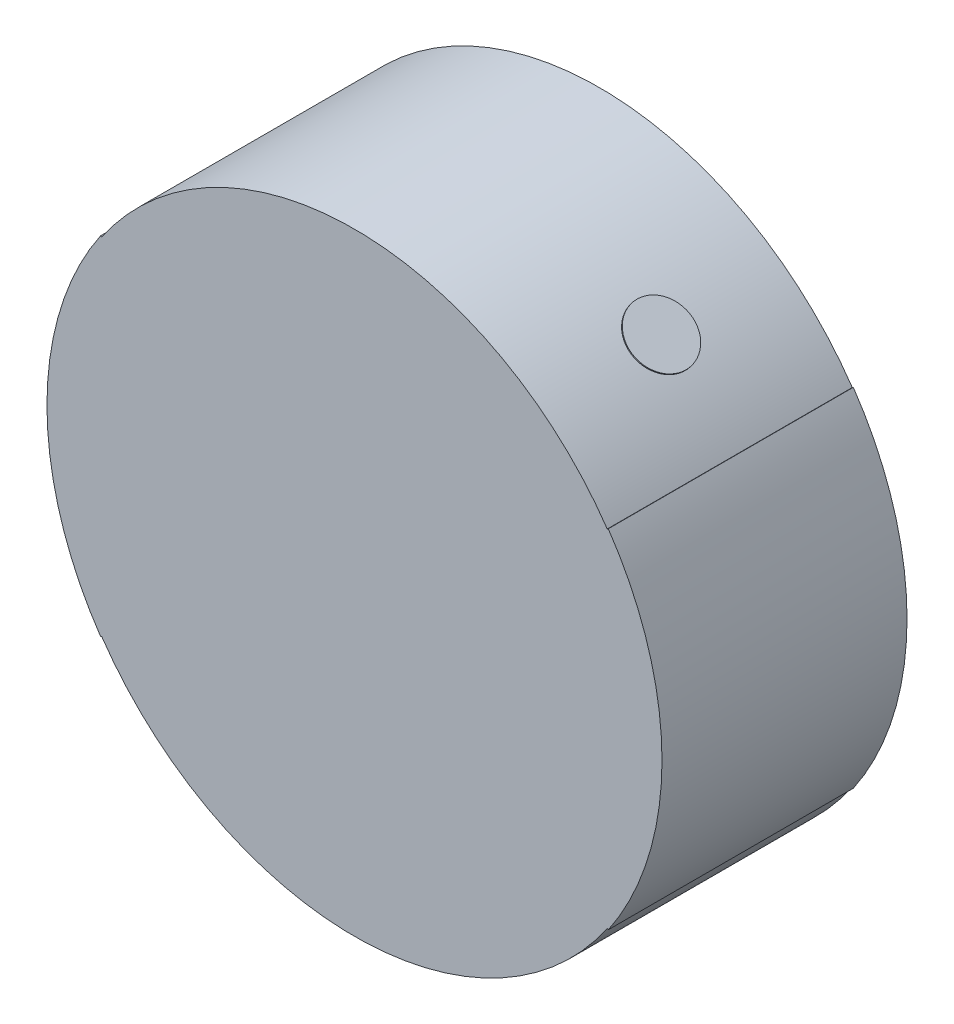
ISO-10303-21;
HEADER;
FILE_DESCRIPTION(('STEP AP214'),'2;1');
FILE_NAME('part.step','',(''),(''),'','','');
FILE_SCHEMA(('AUTOMOTIVE_DESIGN { 1 0 10303 214 1 1 1 1 }'));
ENDSEC;
DATA;
#1=APPLICATION_CONTEXT('core data for automotive mechanical design processes');
#2=APPLICATION_PROTOCOL_DEFINITION('international standard','automotive_design',2000,#1);
#3=PRODUCT_CONTEXT('',#1,'mechanical');
#4=PRODUCT('Part','Part','',(#3));
#5=PRODUCT_RELATED_PRODUCT_CATEGORY('part','',(#4));
#6=PRODUCT_DEFINITION_FORMATION('','',#4);
#7=PRODUCT_DEFINITION_CONTEXT('part definition',#1,'design');
#8=PRODUCT_DEFINITION('design','',#6,#7);
#9=PRODUCT_DEFINITION_SHAPE('','',#8);
#10=(LENGTH_UNIT() NAMED_UNIT(*) SI_UNIT(.MILLI.,.METRE.));
#11=(NAMED_UNIT(*) PLANE_ANGLE_UNIT() SI_UNIT($,.RADIAN.));
#12=(NAMED_UNIT(*) SI_UNIT($,.STERADIAN.) SOLID_ANGLE_UNIT());
#13=UNCERTAINTY_MEASURE_WITH_UNIT(LENGTH_MEASURE(1.E-05),#10,'distance_accuracy_value','');
#14=(GEOMETRIC_REPRESENTATION_CONTEXT(3) GLOBAL_UNCERTAINTY_ASSIGNED_CONTEXT((#13)) GLOBAL_UNIT_ASSIGNED_CONTEXT((#10,
#11,#12)) REPRESENTATION_CONTEXT('',''));
#15=CARTESIAN_POINT('',(0.,0.,0.));
#16=DIRECTION('',(0.,0.,1.));
#17=DIRECTION('',(1.,0.,0.));
#18=AXIS2_PLACEMENT_3D('',#15,#16,#17);
#19=CARTESIAN_POINT('',(1.506,2.008,0.));
#20=DIRECTION('',(-0.6,-0.8,0.));
#21=DIRECTION('',(0.8,-0.6,0.));
#22=AXIS2_PLACEMENT_3D('',#19,#20,#21);
#23=CYLINDRICAL_SURFACE('',#22,0.25);
#24=CARTESIAN_POINT('',(1.506,2.008,0.));
#25=DIRECTION('',(0.6,0.8,0.));
#26=DIRECTION('',(-0.8,0.6,0.));
#27=AXIS2_PLACEMENT_3D('',#24,#25,#26);
#28=CIRCLE('',#27,0.25);
#29=CARTESIAN_POINT('',(1.306,2.158,0.));
#30=VERTEX_POINT('',#29);
#31=EDGE_CURVE('E11',#30,#30,#28,.T.);
#32=ORIENTED_EDGE('',*,*,#31,.F.);
#33=EDGE_LOOP('',(#32));
#34=FACE_BOUND('',#33,.T.);
#35=CARTESIAN_POINT('',(1.5,2.,0.));
#36=DIRECTION('',(0.6,0.8,0.));
#37=DIRECTION('',(-0.8,0.6,0.));
#38=AXIS2_PLACEMENT_3D('',#35,#36,#37);
#39=CIRCLE('',#38,0.25);
#40=CARTESIAN_POINT('',(1.3,2.15,0.));
#41=VERTEX_POINT('',#40);
#42=EDGE_CURVE('E46',#41,#41,#39,.T.);
#43=ORIENTED_EDGE('',*,*,#42,.T.);
#44=EDGE_LOOP('',(#43));
#45=FACE_BOUND('',#44,.T.);
#46=ADVANCED_FACE('F43',(#34,#45),#23,.T.);
#47=CARTESIAN_POINT('',(1.506,2.008,0.));
#48=DIRECTION('',(0.6,0.8,0.));
#49=DIRECTION('',(-0.8,0.6,0.));
#50=AXIS2_PLACEMENT_3D('',#47,#48,#49);
#51=PLANE('',#50);
#52=ORIENTED_EDGE('',*,*,#31,.T.);
#53=EDGE_LOOP('',(#52));
#54=FACE_BOUND('',#53,.T.);
#55=ADVANCED_FACE('F58',(#54),#51,.T.);
#56=CARTESIAN_POINT('',(1.5,2.,0.));
#57=DIRECTION('',(0.6,0.8,0.));
#58=DIRECTION('',(-0.8,0.6,0.));
#59=AXIS2_PLACEMENT_3D('',#56,#57,#58);
#60=PLANE('',#59);
#61=ORIENTED_EDGE('',*,*,#42,.F.);
#62=EDGE_LOOP('',(#61));
#63=FACE_BOUND('',#62,.T.);
#64=ADVANCED_FACE('F56',(#63),#60,.F.);
#65=CLOSED_SHELL('',(#46,#55,#64));
#66=MANIFOLD_SOLID_BREP('B2',#65);
#67=CARTESIAN_POINT('',(0.,0.,1.));
#68=DIRECTION('',(0.,0.,-1.));
#69=DIRECTION('',(-1.,0.,0.));
#70=AXIS2_PLACEMENT_3D('',#67,#68,#69);
#71=CYLINDRICAL_SURFACE('',#70,2.5);
#72=DIRECTION('',(0.,0.,1.));
#73=VECTOR('',#72,1.);
#74=CARTESIAN_POINT('',(-2.0633390372742,-1.41160618348759,-1.));
#75=LINE('',#74,#73);
#76=CARTESIAN_POINT('',(-2.0633390372742,-1.41160618348759,-1.));
#77=VERTEX_POINT('',#76);
#78=CARTESIAN_POINT('',(-2.0633390372742,-1.41160618348759,1.));
#79=VERTEX_POINT('',#78);
#80=EDGE_CURVE('E178',#77,#79,#75,.T.);
#81=ORIENTED_EDGE('',*,*,#80,.F.);
#82=CARTESIAN_POINT('',(0.,0.,-1.));
#83=DIRECTION('',(0.,0.,1.));
#84=DIRECTION('',(1.,0.,0.));
#85=AXIS2_PLACEMENT_3D('',#82,#83,#84);
#86=CIRCLE('',#85,2.5);
#87=CARTESIAN_POINT('',(2.0633390372742,-1.41160618348759,-1.));
#88=VERTEX_POINT('',#87);
#89=EDGE_CURVE('E205',#77,#88,#86,.T.);
#90=ORIENTED_EDGE('',*,*,#89,.T.);
#91=DIRECTION('',(0.,0.,1.));
#92=VECTOR('',#91,1.);
#93=CARTESIAN_POINT('',(2.0633390372742,-1.41160618348759,-1.));
#94=LINE('',#93,#92);
#95=CARTESIAN_POINT('',(2.0633390372742,-1.41160618348759,1.));
#96=VERTEX_POINT('',#95);
#97=EDGE_CURVE('E194',#88,#96,#94,.T.);
#98=ORIENTED_EDGE('',*,*,#97,.T.);
#99=CARTESIAN_POINT('',(0.,0.,1.));
#100=DIRECTION('',(0.,0.,1.));
#101=DIRECTION('',(1.,0.,0.));
#102=AXIS2_PLACEMENT_3D('',#99,#100,#101);
#103=CIRCLE('',#102,2.5);
#104=EDGE_CURVE('E92',#79,#96,#103,.T.);
#105=ORIENTED_EDGE('',*,*,#104,.F.);
#106=EDGE_LOOP('',(#81,#90,#98,#105));
#107=FACE_BOUND('',#106,.T.);
#108=ADVANCED_FACE('F84',(#107),#71,.T.);
#109=DIRECTION('',(0.,0.,1.));
#110=VECTOR('',#109,1.);
#111=CARTESIAN_POINT('',(-2.0633390372742,1.41160618348759,-1.));
#112=LINE('',#111,#110);
#113=CARTESIAN_POINT('',(-2.0633390372742,1.41160618348759,-1.));
#114=VERTEX_POINT('',#113);
#115=CARTESIAN_POINT('',(-2.0633390372742,1.41160618348759,1.));
#116=VERTEX_POINT('',#115);
#117=EDGE_CURVE('E106',#114,#116,#112,.T.);
#118=ORIENTED_EDGE('',*,*,#117,.T.);
#119=CARTESIAN_POINT('',(2.0633390372742,1.41160618348759,1.));
#120=VERTEX_POINT('',#119);
#121=EDGE_CURVE('E41',#120,#116,#103,.T.);
#122=ORIENTED_EDGE('',*,*,#121,.F.);
#123=DIRECTION('',(0.,0.,1.));
#124=VECTOR('',#123,1.);
#125=CARTESIAN_POINT('',(2.0633390372742,1.41160618348759,-1.));
#126=LINE('',#125,#124);
#127=CARTESIAN_POINT('',(2.0633390372742,1.41160618348759,-1.));
#128=VERTEX_POINT('',#127);
#129=EDGE_CURVE('E202',#128,#120,#126,.T.);
#130=ORIENTED_EDGE('',*,*,#129,.F.);
#131=EDGE_CURVE('E87',#128,#114,#86,.T.);
#132=ORIENTED_EDGE('',*,*,#131,.T.);
#133=EDGE_LOOP('',(#118,#122,#130,#132));
#134=FACE_BOUND('',#133,.T.);
#135=ADVANCED_FACE('F220',(#134),#71,.T.);
#136=CARTESIAN_POINT('',(0.,0.,1.));
#137=DIRECTION('',(0.,0.,1.));
#138=DIRECTION('',(1.,0.,0.));
#139=AXIS2_PLACEMENT_3D('',#136,#137,#138);
#140=PLANE('',#139);
#141=ORIENTED_EDGE('',*,*,#121,.T.);
#142=DIRECTION('',(0.825335614909667,-0.564642473395052,0.));
#143=VECTOR('',#142,1.);
#144=CARTESIAN_POINT('',(-2.0633390372742,1.41160618348759,1.));
#145=LINE('',#144,#143);
#146=CARTESIAN_POINT('',(-2.07159239342329,1.41725260822154,1.));
#147=VERTEX_POINT('',#146);
#148=EDGE_CURVE('E175',#147,#116,#145,.T.);
#149=ORIENTED_EDGE('',*,*,#148,.F.);
#150=CARTESIAN_POINT('',(0.,0.,1.));
#151=DIRECTION('',(0.,0.,-1.));
#152=DIRECTION('',(1.,0.,0.));
#153=AXIS2_PLACEMENT_3D('',#150,#151,#152);
#154=CIRCLE('',#153,2.51);
#155=CARTESIAN_POINT('',(-2.07159239342329,-1.41725260822154,1.));
#156=VERTEX_POINT('',#155);
#157=EDGE_CURVE('E163',#156,#147,#154,.T.);
#158=ORIENTED_EDGE('',*,*,#157,.F.);
#159=DIRECTION('',(-0.825335614909681,-0.564642473395032,0.));
#160=VECTOR('',#159,1.);
#161=CARTESIAN_POINT('',(-2.0633390372742,-1.41160618348759,1.));
#162=LINE('',#161,#160);
#163=EDGE_CURVE('E170',#79,#156,#162,.T.);
#164=ORIENTED_EDGE('',*,*,#163,.F.);
#165=ORIENTED_EDGE('',*,*,#104,.T.);
#166=DIRECTION('',(0.825335614909681,-0.564642473395032,0.));
#167=VECTOR('',#166,1.);
#168=CARTESIAN_POINT('',(2.0633390372742,-1.41160618348759,1.));
#169=LINE('',#168,#167);
#170=CARTESIAN_POINT('',(2.07159239342329,-1.41725260822154,1.));
#171=VERTEX_POINT('',#170);
#172=EDGE_CURVE('E181',#96,#171,#169,.T.);
#173=ORIENTED_EDGE('',*,*,#172,.T.);
#174=CARTESIAN_POINT('',(0.,0.,1.));
#175=DIRECTION('',(0.,0.,1.));
#176=DIRECTION('',(-1.,0.,0.));
#177=AXIS2_PLACEMENT_3D('',#174,#175,#176);
#178=CIRCLE('',#177,2.51);
#179=CARTESIAN_POINT('',(2.07159239342329,1.41725260822154,1.));
#180=VERTEX_POINT('',#179);
#181=EDGE_CURVE('E197',#171,#180,#178,.T.);
#182=ORIENTED_EDGE('',*,*,#181,.T.);
#183=DIRECTION('',(-0.825335614909667,-0.564642473395052,0.));
#184=VECTOR('',#183,1.);
#185=CARTESIAN_POINT('',(2.0633390372742,1.41160618348759,1.));
#186=LINE('',#185,#184);
#187=EDGE_CURVE('E188',#180,#120,#186,.T.);
#188=ORIENTED_EDGE('',*,*,#187,.T.);
#189=EDGE_LOOP('',(#141,#149,#158,#164,#165,#173,#182,#188));
#190=FACE_BOUND('',#189,.T.);
#191=ADVANCED_FACE('F217',(#190),#140,.T.);
#192=CARTESIAN_POINT('',(0.,0.,-1.));
#193=DIRECTION('',(0.,0.,1.));
#194=DIRECTION('',(1.,0.,0.));
#195=AXIS2_PLACEMENT_3D('',#192,#193,#194);
#196=PLANE('',#195);
#197=ORIENTED_EDGE('',*,*,#131,.F.);
#198=DIRECTION('',(-0.825335614909667,-0.564642473395052,0.));
#199=VECTOR('',#198,1.);
#200=CARTESIAN_POINT('',(2.0633390372742,1.41160618348759,-1.));
#201=LINE('',#200,#199);
#202=CARTESIAN_POINT('',(2.07159239342329,1.41725260822154,-1.));
#203=VERTEX_POINT('',#202);
#204=EDGE_CURVE('E191',#203,#128,#201,.T.);
#205=ORIENTED_EDGE('',*,*,#204,.F.);
#206=CARTESIAN_POINT('',(0.,0.,-1.));
#207=DIRECTION('',(0.,0.,1.));
#208=DIRECTION('',(-1.,0.,0.));
#209=AXIS2_PLACEMENT_3D('',#206,#207,#208);
#210=CIRCLE('',#209,2.51);
#211=CARTESIAN_POINT('',(2.07159239342329,-1.41725260822154,-1.));
#212=VERTEX_POINT('',#211);
#213=EDGE_CURVE('E187',#212,#203,#210,.T.);
#214=ORIENTED_EDGE('',*,*,#213,.F.);
#215=DIRECTION('',(0.825335614909681,-0.564642473395032,0.));
#216=VECTOR('',#215,1.);
#217=CARTESIAN_POINT('',(2.0633390372742,-1.41160618348759,-1.));
#218=LINE('',#217,#216);
#219=EDGE_CURVE('E184',#88,#212,#218,.T.);
#220=ORIENTED_EDGE('',*,*,#219,.F.);
#221=ORIENTED_EDGE('',*,*,#89,.F.);
#222=DIRECTION('',(-0.825335614909681,-0.564642473395032,0.));
#223=VECTOR('',#222,1.);
#224=CARTESIAN_POINT('',(-2.0633390372742,-1.41160618348759,-1.));
#225=LINE('',#224,#223);
#226=CARTESIAN_POINT('',(-2.07159239342329,-1.41725260822154,-1.));
#227=VERTEX_POINT('',#226);
#228=EDGE_CURVE('E154',#77,#227,#225,.T.);
#229=ORIENTED_EDGE('',*,*,#228,.T.);
#230=CARTESIAN_POINT('',(0.,0.,-1.));
#231=DIRECTION('',(0.,0.,-1.));
#232=DIRECTION('',(1.,0.,0.));
#233=AXIS2_PLACEMENT_3D('',#230,#231,#232);
#234=CIRCLE('',#233,2.51);
#235=CARTESIAN_POINT('',(-2.07159239342329,1.41725260822154,-1.));
#236=VERTEX_POINT('',#235);
#237=EDGE_CURVE('E148',#227,#236,#234,.T.);
#238=ORIENTED_EDGE('',*,*,#237,.T.);
#239=DIRECTION('',(0.825335614909667,-0.564642473395052,0.));
#240=VECTOR('',#239,1.);
#241=CARTESIAN_POINT('',(-2.0633390372742,1.41160618348759,-1.));
#242=LINE('',#241,#240);
#243=EDGE_CURVE('E152',#236,#114,#242,.T.);
#244=ORIENTED_EDGE('',*,*,#243,.T.);
#245=EDGE_LOOP('',(#197,#205,#214,#220,#221,#229,#238,#244));
#246=FACE_BOUND('',#245,.T.);
#247=ADVANCED_FACE('F150',(#246),#196,.F.);
#248=CARTESIAN_POINT('',(2.0633390372742,1.41160618348759,-1.));
#249=DIRECTION('',(-0.564642473395052,0.825335614909667,0.));
#250=DIRECTION('',(-0.825335614909667,-0.564642473395052,0.));
#251=AXIS2_PLACEMENT_3D('',#248,#249,#250);
#252=PLANE('',#251);
#253=ORIENTED_EDGE('',*,*,#187,.F.);
#254=DIRECTION('',(0.,0.,1.));
#255=VECTOR('',#254,1.);
#256=CARTESIAN_POINT('',(2.07159239342329,1.41725260822154,-1.));
#257=LINE('',#256,#255);
#258=EDGE_CURVE('E206',#203,#180,#257,.T.);
#259=ORIENTED_EDGE('',*,*,#258,.F.);
#260=ORIENTED_EDGE('',*,*,#204,.T.);
#261=ORIENTED_EDGE('',*,*,#129,.T.);
#262=EDGE_LOOP('',(#253,#259,#260,#261));
#263=FACE_BOUND('',#262,.T.);
#264=ADVANCED_FACE('F224',(#263),#252,.T.);
#265=CARTESIAN_POINT('',(0.,0.,-1.));
#266=DIRECTION('',(0.,0.,1.));
#267=DIRECTION('',(1.,0.,0.));
#268=AXIS2_PLACEMENT_3D('',#265,#266,#267);
#269=CYLINDRICAL_SURFACE('',#268,2.51);
#270=ORIENTED_EDGE('',*,*,#181,.F.);
#271=DIRECTION('',(0.,0.,1.));
#272=VECTOR('',#271,1.);
#273=CARTESIAN_POINT('',(2.07159239342329,-1.41725260822154,-1.));
#274=LINE('',#273,#272);
#275=EDGE_CURVE('E208',#212,#171,#274,.T.);
#276=ORIENTED_EDGE('',*,*,#275,.F.);
#277=ORIENTED_EDGE('',*,*,#213,.T.);
#278=ORIENTED_EDGE('',*,*,#258,.T.);
#279=EDGE_LOOP('',(#270,#276,#277,#278));
#280=FACE_BOUND('',#279,.T.);
#281=ADVANCED_FACE('F226',(#280),#269,.T.);
#282=CARTESIAN_POINT('',(2.0633390372742,-1.41160618348759,-1.));
#283=DIRECTION('',(-0.564642473395032,-0.825335614909681,0.));
#284=DIRECTION('',(0.825335614909681,-0.564642473395032,0.));
#285=AXIS2_PLACEMENT_3D('',#282,#283,#284);
#286=PLANE('',#285);
#287=ORIENTED_EDGE('',*,*,#172,.F.);
#288=ORIENTED_EDGE('',*,*,#97,.F.);
#289=ORIENTED_EDGE('',*,*,#219,.T.);
#290=ORIENTED_EDGE('',*,*,#275,.T.);
#291=EDGE_LOOP('',(#287,#288,#289,#290));
#292=FACE_BOUND('',#291,.T.);
#293=ADVANCED_FACE('F214',(#292),#286,.T.);
#294=CARTESIAN_POINT('',(-2.0633390372742,-1.41160618348759,-1.));
#295=DIRECTION('',(-0.564642473395032,0.825335614909681,0.));
#296=DIRECTION('',(-0.825335614909681,-0.564642473395032,0.));
#297=AXIS2_PLACEMENT_3D('',#294,#295,#296);
#298=PLANE('',#297);
#299=ORIENTED_EDGE('',*,*,#163,.T.);
#300=DIRECTION('',(0.,0.,1.));
#301=VECTOR('',#300,1.);
#302=CARTESIAN_POINT('',(-2.07159239342329,-1.41725260822154,-1.));
#303=LINE('',#302,#301);
#304=EDGE_CURVE('E167',#227,#156,#303,.T.);
#305=ORIENTED_EDGE('',*,*,#304,.F.);
#306=ORIENTED_EDGE('',*,*,#228,.F.);
#307=ORIENTED_EDGE('',*,*,#80,.T.);
#308=EDGE_LOOP('',(#299,#305,#306,#307));
#309=FACE_BOUND('',#308,.T.);
#310=ADVANCED_FACE('F233',(#309),#298,.F.);
#311=CARTESIAN_POINT('',(0.,0.,-1.));
#312=DIRECTION('',(0.,0.,1.));
#313=DIRECTION('',(1.,0.,0.));
#314=AXIS2_PLACEMENT_3D('',#311,#312,#313);
#315=CYLINDRICAL_SURFACE('',#314,2.51);
#316=ORIENTED_EDGE('',*,*,#157,.T.);
#317=DIRECTION('',(0.,0.,1.));
#318=VECTOR('',#317,1.);
#319=CARTESIAN_POINT('',(-2.07159239342329,1.41725260822154,-1.));
#320=LINE('',#319,#318);
#321=EDGE_CURVE('E160',#236,#147,#320,.T.);
#322=ORIENTED_EDGE('',*,*,#321,.F.);
#323=ORIENTED_EDGE('',*,*,#237,.F.);
#324=ORIENTED_EDGE('',*,*,#304,.T.);
#325=EDGE_LOOP('',(#316,#322,#323,#324));
#326=FACE_BOUND('',#325,.T.);
#327=ADVANCED_FACE('F161',(#326),#315,.T.);
#328=CARTESIAN_POINT('',(-2.0633390372742,1.41160618348759,-1.));
#329=DIRECTION('',(-0.564642473395052,-0.825335614909667,0.));
#330=DIRECTION('',(0.825335614909667,-0.564642473395052,0.));
#331=AXIS2_PLACEMENT_3D('',#328,#329,#330);
#332=PLANE('',#331);
#333=ORIENTED_EDGE('',*,*,#148,.T.);
#334=ORIENTED_EDGE('',*,*,#117,.F.);
#335=ORIENTED_EDGE('',*,*,#243,.F.);
#336=ORIENTED_EDGE('',*,*,#321,.T.);
#337=EDGE_LOOP('',(#333,#334,#335,#336));
#338=FACE_BOUND('',#337,.T.);
#339=ADVANCED_FACE('F169',(#338),#332,.F.);
#340=CLOSED_SHELL('',(#108,#135,#191,#247,#264,#281,#293,#310,#327,#339));
#341=MANIFOLD_SOLID_BREP('B6',#340);
#342=ADVANCED_BREP_SHAPE_REPRESENTATION('',(#18,#66,#341),#14);
#343=SHAPE_DEFINITION_REPRESENTATION(#9,#342);
ENDSEC;
END-ISO-10303-21;
